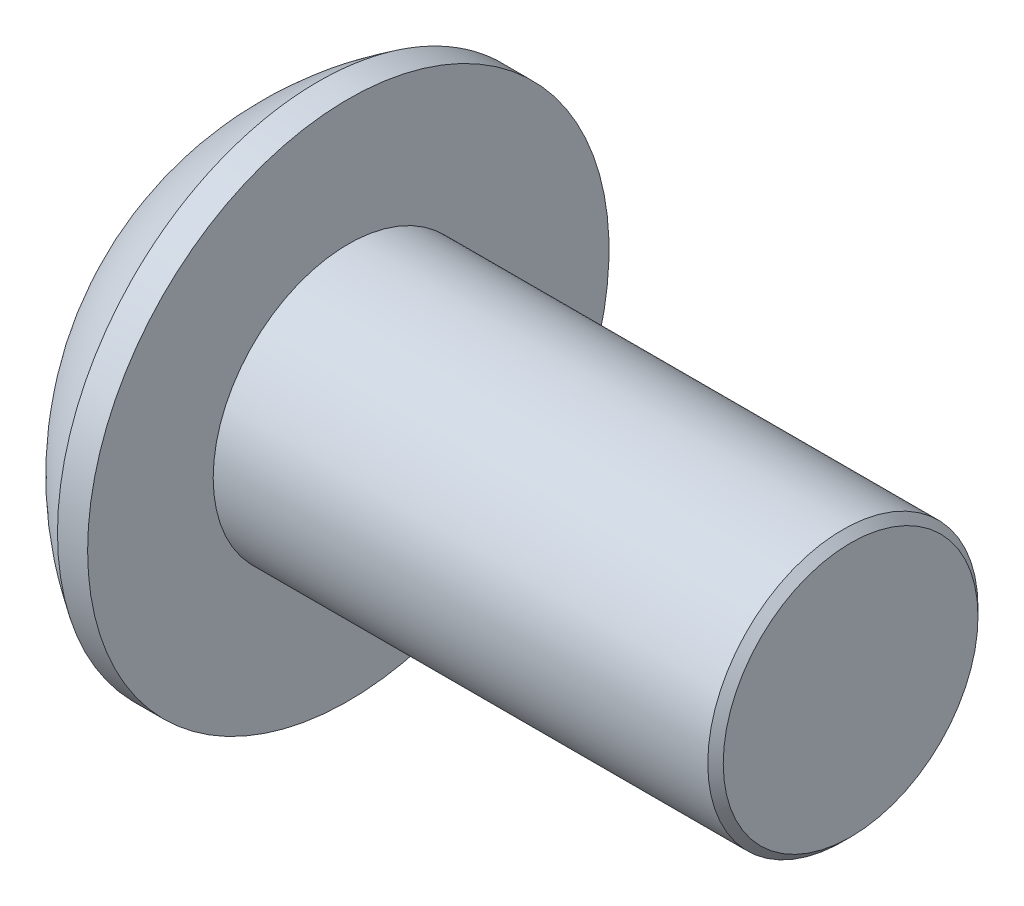
ISO-10303-21;
HEADER;
FILE_DESCRIPTION(('STEP AP214'),'2;1');
FILE_NAME('part.step','',(''),(''),'','','');
FILE_SCHEMA(('AUTOMOTIVE_DESIGN { 1 0 10303 214 1 1 1 1 }'));
ENDSEC;
DATA;
#1=APPLICATION_CONTEXT('core data for automotive mechanical design processes');
#2=APPLICATION_PROTOCOL_DEFINITION('international standard','automotive_design',2000,#1);
#3=PRODUCT_CONTEXT('',#1,'mechanical');
#4=PRODUCT('Part','Part','',(#3));
#5=PRODUCT_RELATED_PRODUCT_CATEGORY('part','',(#4));
#6=PRODUCT_DEFINITION_FORMATION('','',#4);
#7=PRODUCT_DEFINITION_CONTEXT('part definition',#1,'design');
#8=PRODUCT_DEFINITION('design','',#6,#7);
#9=PRODUCT_DEFINITION_SHAPE('','',#8);
#10=(LENGTH_UNIT() NAMED_UNIT(*) SI_UNIT(.MILLI.,.METRE.));
#11=(NAMED_UNIT(*) PLANE_ANGLE_UNIT() SI_UNIT($,.RADIAN.));
#12=(NAMED_UNIT(*) SI_UNIT($,.STERADIAN.) SOLID_ANGLE_UNIT());
#13=UNCERTAINTY_MEASURE_WITH_UNIT(LENGTH_MEASURE(1.E-05),#10,'distance_accuracy_value','');
#14=(GEOMETRIC_REPRESENTATION_CONTEXT(3) GLOBAL_UNCERTAINTY_ASSIGNED_CONTEXT((#13)) GLOBAL_UNIT_ASSIGNED_CONTEXT((#10,
#11,#12)) REPRESENTATION_CONTEXT('',''));
#15=CARTESIAN_POINT('',(0.,0.,0.));
#16=DIRECTION('',(0.,0.,1.));
#17=DIRECTION('',(1.,0.,0.));
#18=AXIS2_PLACEMENT_3D('',#15,#16,#17);
#19=CARTESIAN_POINT('',(1.32080000000034,0.,0.));
#20=DIRECTION('',(-1.,0.,0.));
#21=DIRECTION('',(0.,0.,1.));
#22=AXIS2_PLACEMENT_3D('',#19,#20,#21);
#23=CONICAL_SURFACE('',#22,1.1937999999998,1.04719755119608);
#24=CARTESIAN_POINT('',(2.01004075135902,0.,4.44089209850063E-13));
#25=VERTEX_POINT('',#24);
#26=VERTEX_LOOP('',#25);
#27=FACE_BOUND('',#26,.T.);
#28=CARTESIAN_POINT('',(1.32080000000009,0.,0.));
#29=DIRECTION('',(-1.,0.,0.));
#30=DIRECTION('',(0.,0.,1.));
#31=AXIS2_PLACEMENT_3D('',#28,#29,#30);
#32=CIRCLE('',#31,1.19380000000024);
#33=CARTESIAN_POINT('',(1.32080000000004,0.,1.19380000000012));
#34=VERTEX_POINT('',#33);
#35=CARTESIAN_POINT('',(1.32080000000004,-1.03386112703797,0.596900000000061));
#36=VERTEX_POINT('',#35);
#37=EDGE_CURVE('E20',#34,#36,#32,.F.);
#38=ORIENTED_EDGE('',*,*,#37,.F.);
#39=CARTESIAN_POINT('',(1.32080000000009,0.,0.));
#40=DIRECTION('',(-1.,0.,0.));
#41=DIRECTION('',(0.,0.,1.));
#42=AXIS2_PLACEMENT_3D('',#39,#40,#41);
#43=CIRCLE('',#42,1.19380000000024);
#44=CARTESIAN_POINT('',(1.32080000000004,1.03386112703797,0.596900000000063));
#45=VERTEX_POINT('',#44);
#46=EDGE_CURVE('E90',#45,#34,#43,.F.);
#47=ORIENTED_EDGE('',*,*,#46,.F.);
#48=CARTESIAN_POINT('',(1.32080000000009,0.,0.));
#49=DIRECTION('',(-1.,0.,0.));
#50=DIRECTION('',(0.,0.,1.));
#51=AXIS2_PLACEMENT_3D('',#48,#49,#50);
#52=CIRCLE('',#51,1.19380000000024);
#53=CARTESIAN_POINT('',(1.32080000000004,1.03386112703797,-0.596900000000063));
#54=VERTEX_POINT('',#53);
#55=EDGE_CURVE('E106',#54,#45,#52,.F.);
#56=ORIENTED_EDGE('',*,*,#55,.F.);
#57=CARTESIAN_POINT('',(1.32080000000009,0.,0.));
#58=DIRECTION('',(-1.,0.,0.));
#59=DIRECTION('',(0.,0.,1.));
#60=AXIS2_PLACEMENT_3D('',#57,#58,#59);
#61=CIRCLE('',#60,1.19380000000024);
#62=CARTESIAN_POINT('',(1.32080000000004,1.49420287879031E-12,-1.19380000000012));
#63=VERTEX_POINT('',#62);
#64=EDGE_CURVE('E450',#63,#54,#61,.F.);
#65=ORIENTED_EDGE('',*,*,#64,.F.);
#66=CARTESIAN_POINT('',(1.32080000000009,0.,0.));
#67=DIRECTION('',(-1.,0.,0.));
#68=DIRECTION('',(0.,0.,1.));
#69=AXIS2_PLACEMENT_3D('',#66,#67,#68);
#70=CIRCLE('',#69,1.19380000000024);
#71=CARTESIAN_POINT('',(1.32080000000004,-1.03386112703797,-0.596900000000062));
#72=VERTEX_POINT('',#71);
#73=EDGE_CURVE('E453',#72,#63,#70,.F.);
#74=ORIENTED_EDGE('',*,*,#73,.F.);
#75=CARTESIAN_POINT('',(1.32080000000009,0.,0.));
#76=DIRECTION('',(-1.,0.,0.));
#77=DIRECTION('',(0.,0.,1.));
#78=AXIS2_PLACEMENT_3D('',#75,#76,#77);
#79=CIRCLE('',#78,1.19380000000024);
#80=EDGE_CURVE('E93',#36,#72,#79,.F.);
#81=ORIENTED_EDGE('',*,*,#80,.F.);
#82=EDGE_LOOP('',(#38,#47,#56,#65,#74,#81));
#83=FACE_BOUND('',#82,.T.);
#84=ADVANCED_FACE('F17',(#27,#83),#23,.F.);
#85=CARTESIAN_POINT('',(1.3208,0.,2.3876));
#86=DIRECTION('',(-1.,0.,0.));
#87=DIRECTION('',(0.,0.,1.));
#88=AXIS2_PLACEMENT_3D('',#85,#86,#87);
#89=PLANE('',#88);
#90=DIRECTION('',(0.,1.,0.));
#91=VECTOR('',#90,1.);
#92=CARTESIAN_POINT('',(1.3208,-0.689240751358576,1.1938));
#93=LINE('',#92,#91);
#94=CARTESIAN_POINT('',(1.3208,-0.689240751358576,1.1938));
#95=VERTEX_POINT('',#94);
#96=EDGE_CURVE('E109',#34,#95,#93,.F.);
#97=ORIENTED_EDGE('',*,*,#96,.F.);
#98=ORIENTED_EDGE('',*,*,#37,.T.);
#99=DIRECTION('',(0.,0.5,0.866025403784439));
#100=VECTOR('',#99,1.);
#101=CARTESIAN_POINT('',(1.3208,-1.37848150271715,0.));
#102=LINE('',#101,#100);
#103=EDGE_CURVE('E112',#95,#36,#102,.F.);
#104=ORIENTED_EDGE('',*,*,#103,.F.);
#105=EDGE_LOOP('',(#97,#98,#104));
#106=FACE_BOUND('',#105,.T.);
#107=ADVANCED_FACE('F110',(#106),#89,.T.);
#108=CARTESIAN_POINT('',(1.3208,0.,2.3876));
#109=DIRECTION('',(-1.,0.,0.));
#110=DIRECTION('',(0.,0.,1.));
#111=AXIS2_PLACEMENT_3D('',#108,#109,#110);
#112=PLANE('',#111);
#113=DIRECTION('',(0.,0.5,0.866025403784439));
#114=VECTOR('',#113,1.);
#115=CARTESIAN_POINT('',(1.3208,-1.37848150271715,0.));
#116=LINE('',#115,#114);
#117=CARTESIAN_POINT('',(1.3208,-1.37848150271715,0.));
#118=VERTEX_POINT('',#117);
#119=EDGE_CURVE('E172',#36,#118,#116,.F.);
#120=ORIENTED_EDGE('',*,*,#119,.F.);
#121=ORIENTED_EDGE('',*,*,#80,.T.);
#122=DIRECTION('',(0.,-0.5,0.866025403784439));
#123=VECTOR('',#122,1.);
#124=CARTESIAN_POINT('',(1.3208,-0.689240751358576,-1.1938));
#125=LINE('',#124,#123);
#126=EDGE_CURVE('E160',#118,#72,#125,.F.);
#127=ORIENTED_EDGE('',*,*,#126,.F.);
#128=EDGE_LOOP('',(#120,#121,#127));
#129=FACE_BOUND('',#128,.T.);
#130=ADVANCED_FACE('F250',(#129),#112,.T.);
#131=CARTESIAN_POINT('',(1.3208,0.,2.3876));
#132=DIRECTION('',(-1.,0.,0.));
#133=DIRECTION('',(0.,0.,1.));
#134=AXIS2_PLACEMENT_3D('',#131,#132,#133);
#135=PLANE('',#134);
#136=DIRECTION('',(0.,-0.5,0.866025403784439));
#137=VECTOR('',#136,1.);
#138=CARTESIAN_POINT('',(1.3208,-0.689240751358576,-1.1938));
#139=LINE('',#138,#137);
#140=CARTESIAN_POINT('',(1.3208,-0.689240751358576,-1.1938));
#141=VERTEX_POINT('',#140);
#142=EDGE_CURVE('E157',#72,#141,#139,.F.);
#143=ORIENTED_EDGE('',*,*,#142,.F.);
#144=ORIENTED_EDGE('',*,*,#73,.T.);
#145=DIRECTION('',(0.,-1.,0.));
#146=VECTOR('',#145,1.);
#147=CARTESIAN_POINT('',(1.3208,0.689240751358575,-1.1938));
#148=LINE('',#147,#146);
#149=EDGE_CURVE('E144',#141,#63,#148,.F.);
#150=ORIENTED_EDGE('',*,*,#149,.F.);
#151=EDGE_LOOP('',(#143,#144,#150));
#152=FACE_BOUND('',#151,.T.);
#153=ADVANCED_FACE('F246',(#152),#135,.T.);
#154=CARTESIAN_POINT('',(1.3208,0.,2.3876));
#155=DIRECTION('',(-1.,0.,0.));
#156=DIRECTION('',(0.,0.,1.));
#157=AXIS2_PLACEMENT_3D('',#154,#155,#156);
#158=PLANE('',#157);
#159=DIRECTION('',(0.,-1.,0.));
#160=VECTOR('',#159,1.);
#161=CARTESIAN_POINT('',(1.3208,0.689240751358575,-1.1938));
#162=LINE('',#161,#160);
#163=CARTESIAN_POINT('',(1.3208,0.689240751358575,-1.1938));
#164=VERTEX_POINT('',#163);
#165=EDGE_CURVE('E141',#63,#164,#162,.F.);
#166=ORIENTED_EDGE('',*,*,#165,.F.);
#167=ORIENTED_EDGE('',*,*,#64,.T.);
#168=DIRECTION('',(0.,-0.500000000000001,-0.866025403784438));
#169=VECTOR('',#168,1.);
#170=CARTESIAN_POINT('',(1.3208,1.37848150271715,0.));
#171=LINE('',#170,#169);
#172=EDGE_CURVE('E129',#164,#54,#171,.F.);
#173=ORIENTED_EDGE('',*,*,#172,.F.);
#174=EDGE_LOOP('',(#166,#167,#173));
#175=FACE_BOUND('',#174,.T.);
#176=ADVANCED_FACE('F242',(#175),#158,.T.);
#177=CARTESIAN_POINT('',(1.3208,0.,2.3876));
#178=DIRECTION('',(-1.,0.,0.));
#179=DIRECTION('',(0.,0.,1.));
#180=AXIS2_PLACEMENT_3D('',#177,#178,#179);
#181=PLANE('',#180);
#182=DIRECTION('',(0.,-0.500000000000001,-0.866025403784438));
#183=VECTOR('',#182,1.);
#184=CARTESIAN_POINT('',(1.3208,1.37848150271715,0.));
#185=LINE('',#184,#183);
#186=CARTESIAN_POINT('',(1.3208,1.37848150271715,0.));
#187=VERTEX_POINT('',#186);
#188=EDGE_CURVE('E126',#54,#187,#185,.F.);
#189=ORIENTED_EDGE('',*,*,#188,.F.);
#190=ORIENTED_EDGE('',*,*,#55,.T.);
#191=DIRECTION('',(0.,0.500000000000001,-0.866025403784438));
#192=VECTOR('',#191,1.);
#193=CARTESIAN_POINT('',(1.3208,0.689240751358575,1.1938));
#194=LINE('',#193,#192);
#195=EDGE_CURVE('E149',#187,#45,#194,.F.);
#196=ORIENTED_EDGE('',*,*,#195,.F.);
#197=EDGE_LOOP('',(#189,#190,#196));
#198=FACE_BOUND('',#197,.T.);
#199=ADVANCED_FACE('F239',(#198),#181,.T.);
#200=CARTESIAN_POINT('',(1.3208,0.,2.3876));
#201=DIRECTION('',(-1.,0.,0.));
#202=DIRECTION('',(0.,0.,1.));
#203=AXIS2_PLACEMENT_3D('',#200,#201,#202);
#204=PLANE('',#203);
#205=DIRECTION('',(0.,0.500000000000001,-0.866025403784438));
#206=VECTOR('',#205,1.);
#207=CARTESIAN_POINT('',(1.3208,0.689240751358575,1.1938));
#208=LINE('',#207,#206);
#209=CARTESIAN_POINT('',(1.3208,0.689240751358575,1.1938));
#210=VERTEX_POINT('',#209);
#211=EDGE_CURVE('E104',#45,#210,#208,.F.);
#212=ORIENTED_EDGE('',*,*,#211,.F.);
#213=ORIENTED_EDGE('',*,*,#46,.T.);
#214=DIRECTION('',(0.,1.,0.));
#215=VECTOR('',#214,1.);
#216=CARTESIAN_POINT('',(1.3208,-0.689240751358576,1.1938));
#217=LINE('',#216,#215);
#218=EDGE_CURVE('E101',#210,#34,#217,.F.);
#219=ORIENTED_EDGE('',*,*,#218,.F.);
#220=EDGE_LOOP('',(#212,#213,#219));
#221=FACE_BOUND('',#220,.T.);
#222=ADVANCED_FACE('F99',(#221),#204,.T.);
#223=CARTESIAN_POINT('',(1.3208,-0.689240751358576,1.1938));
#224=DIRECTION('',(0.,0.,-1.));
#225=DIRECTION('',(0.,1.,0.));
#226=AXIS2_PLACEMENT_3D('',#223,#224,#225);
#227=PLANE('',#226);
#228=DIRECTION('',(0.,1.,0.));
#229=VECTOR('',#228,1.);
#230=CARTESIAN_POINT('',(0.,0.,1.1938));
#231=LINE('',#230,#229);
#232=CARTESIAN_POINT('',(0.,0.689240751358575,1.1938));
#233=VERTEX_POINT('',#232);
#234=CARTESIAN_POINT('',(0.,-0.689240751358576,1.1938));
#235=VERTEX_POINT('',#234);
#236=EDGE_CURVE('E133',#233,#235,#231,.F.);
#237=ORIENTED_EDGE('',*,*,#236,.F.);
#238=DIRECTION('',(1.,0.,0.));
#239=VECTOR('',#238,1.);
#240=CARTESIAN_POINT('',(1.3208,0.689240751358575,1.1938));
#241=LINE('',#240,#239);
#242=EDGE_CURVE('E118',#210,#233,#241,.F.);
#243=ORIENTED_EDGE('',*,*,#242,.F.);
#244=ORIENTED_EDGE('',*,*,#218,.T.);
#245=ORIENTED_EDGE('',*,*,#96,.T.);
#246=DIRECTION('',(1.,0.,0.));
#247=VECTOR('',#246,1.);
#248=CARTESIAN_POINT('',(1.3208,-0.689240751358576,1.1938));
#249=LINE('',#248,#247);
#250=EDGE_CURVE('E169',#235,#95,#249,.T.);
#251=ORIENTED_EDGE('',*,*,#250,.F.);
#252=EDGE_LOOP('',(#237,#243,#244,#245,#251));
#253=FACE_BOUND('',#252,.T.);
#254=ADVANCED_FACE('F116',(#253),#227,.T.);
#255=CARTESIAN_POINT('',(1.3208,-1.37848150271715,0.));
#256=DIRECTION('',(0.,0.866025403784439,-0.5));
#257=DIRECTION('',(0.,0.5,0.866025403784439));
#258=AXIS2_PLACEMENT_3D('',#255,#256,#257);
#259=PLANE('',#258);
#260=DIRECTION('',(0.,-0.5,-0.866025403784439));
#261=VECTOR('',#260,1.);
#262=CARTESIAN_POINT('',(0.,-0.689240751358576,1.1938));
#263=LINE('',#262,#261);
#264=CARTESIAN_POINT('',(0.,-1.37848150271715,0.));
#265=VERTEX_POINT('',#264);
#266=EDGE_CURVE('E437',#235,#265,#263,.T.);
#267=ORIENTED_EDGE('',*,*,#266,.F.);
#268=ORIENTED_EDGE('',*,*,#250,.T.);
#269=ORIENTED_EDGE('',*,*,#103,.T.);
#270=ORIENTED_EDGE('',*,*,#119,.T.);
#271=DIRECTION('',(1.,0.,0.));
#272=VECTOR('',#271,1.);
#273=CARTESIAN_POINT('',(1.3208,-1.37848150271715,0.));
#274=LINE('',#273,#272);
#275=EDGE_CURVE('E154',#265,#118,#274,.T.);
#276=ORIENTED_EDGE('',*,*,#275,.F.);
#277=EDGE_LOOP('',(#267,#268,#269,#270,#276));
#278=FACE_BOUND('',#277,.T.);
#279=ADVANCED_FACE('F230',(#278),#259,.T.);
#280=CARTESIAN_POINT('',(1.3208,-0.689240751358576,-1.1938));
#281=DIRECTION('',(0.,0.866025403784439,0.5));
#282=DIRECTION('',(0.,-0.5,0.866025403784439));
#283=AXIS2_PLACEMENT_3D('',#280,#281,#282);
#284=PLANE('',#283);
#285=DIRECTION('',(0.,0.5,-0.866025403784439));
#286=VECTOR('',#285,1.);
#287=CARTESIAN_POINT('',(0.,-1.37848150271715,0.));
#288=LINE('',#287,#286);
#289=CARTESIAN_POINT('',(0.,-0.689240751358576,-1.1938));
#290=VERTEX_POINT('',#289);
#291=EDGE_CURVE('E434',#265,#290,#288,.T.);
#292=ORIENTED_EDGE('',*,*,#291,.F.);
#293=ORIENTED_EDGE('',*,*,#275,.T.);
#294=ORIENTED_EDGE('',*,*,#126,.T.);
#295=ORIENTED_EDGE('',*,*,#142,.T.);
#296=DIRECTION('',(1.,0.,0.));
#297=VECTOR('',#296,1.);
#298=CARTESIAN_POINT('',(1.3208,-0.689240751358576,-1.1938));
#299=LINE('',#298,#297);
#300=EDGE_CURVE('E138',#290,#141,#299,.T.);
#301=ORIENTED_EDGE('',*,*,#300,.F.);
#302=EDGE_LOOP('',(#292,#293,#294,#295,#301));
#303=FACE_BOUND('',#302,.T.);
#304=ADVANCED_FACE('F226',(#303),#284,.T.);
#305=CARTESIAN_POINT('',(1.3208,0.689240751358575,-1.1938));
#306=DIRECTION('',(0.,0.,1.));
#307=DIRECTION('',(0.,-1.,0.));
#308=AXIS2_PLACEMENT_3D('',#305,#306,#307);
#309=PLANE('',#308);
#310=DIRECTION('',(0.,1.,0.));
#311=VECTOR('',#310,1.);
#312=CARTESIAN_POINT('',(0.,0.,-1.1938));
#313=LINE('',#312,#311);
#314=CARTESIAN_POINT('',(0.,0.689240751358575,-1.1938));
#315=VERTEX_POINT('',#314);
#316=EDGE_CURVE('E431',#290,#315,#313,.T.);
#317=ORIENTED_EDGE('',*,*,#316,.F.);
#318=ORIENTED_EDGE('',*,*,#300,.T.);
#319=ORIENTED_EDGE('',*,*,#149,.T.);
#320=ORIENTED_EDGE('',*,*,#165,.T.);
#321=DIRECTION('',(1.,0.,0.));
#322=VECTOR('',#321,1.);
#323=CARTESIAN_POINT('',(1.3208,0.689240751358575,-1.1938));
#324=LINE('',#323,#322);
#325=EDGE_CURVE('E128',#315,#164,#324,.T.);
#326=ORIENTED_EDGE('',*,*,#325,.F.);
#327=EDGE_LOOP('',(#317,#318,#319,#320,#326));
#328=FACE_BOUND('',#327,.T.);
#329=ADVANCED_FACE('F223',(#328),#309,.T.);
#330=CARTESIAN_POINT('',(1.3208,1.37848150271715,0.));
#331=DIRECTION('',(0.,-0.866025403784438,0.500000000000001));
#332=DIRECTION('',(0.,-0.500000000000001,-0.866025403784438));
#333=AXIS2_PLACEMENT_3D('',#330,#331,#332);
#334=PLANE('',#333);
#335=DIRECTION('',(0.,0.500000000000001,0.866025403784438));
#336=VECTOR('',#335,1.);
#337=CARTESIAN_POINT('',(0.,0.689240751358575,-1.1938));
#338=LINE('',#337,#336);
#339=CARTESIAN_POINT('',(0.,1.37848150271715,0.));
#340=VERTEX_POINT('',#339);
#341=EDGE_CURVE('E428',#315,#340,#338,.T.);
#342=ORIENTED_EDGE('',*,*,#341,.F.);
#343=ORIENTED_EDGE('',*,*,#325,.T.);
#344=ORIENTED_EDGE('',*,*,#172,.T.);
#345=ORIENTED_EDGE('',*,*,#188,.T.);
#346=DIRECTION('',(1.,0.,0.));
#347=VECTOR('',#346,1.);
#348=CARTESIAN_POINT('',(1.3208,1.37848150271715,0.));
#349=LINE('',#348,#347);
#350=EDGE_CURVE('E35',#340,#187,#349,.T.);
#351=ORIENTED_EDGE('',*,*,#350,.F.);
#352=EDGE_LOOP('',(#342,#343,#344,#345,#351));
#353=FACE_BOUND('',#352,.T.);
#354=ADVANCED_FACE('F219',(#353),#334,.T.);
#355=CARTESIAN_POINT('',(1.3208,0.689240751358575,1.1938));
#356=DIRECTION('',(0.,-0.866025403784438,-0.500000000000001));
#357=DIRECTION('',(0.,0.500000000000001,-0.866025403784438));
#358=AXIS2_PLACEMENT_3D('',#355,#356,#357);
#359=PLANE('',#358);
#360=DIRECTION('',(0.,-0.500000000000001,0.866025403784438));
#361=VECTOR('',#360,1.);
#362=CARTESIAN_POINT('',(0.,1.37848150271715,0.));
#363=LINE('',#362,#361);
#364=EDGE_CURVE('E205',#340,#233,#363,.T.);
#365=ORIENTED_EDGE('',*,*,#364,.F.);
#366=ORIENTED_EDGE('',*,*,#350,.T.);
#367=ORIENTED_EDGE('',*,*,#195,.T.);
#368=ORIENTED_EDGE('',*,*,#211,.T.);
#369=ORIENTED_EDGE('',*,*,#242,.T.);
#370=EDGE_LOOP('',(#365,#366,#367,#368,#369));
#371=FACE_BOUND('',#370,.T.);
#372=ADVANCED_FACE('F215',(#371),#359,.T.);
#373=CARTESIAN_POINT('',(0.,0.,0.));
#374=DIRECTION('',(-1.,0.,0.));
#375=DIRECTION('',(0.,0.,1.));
#376=AXIS2_PLACEMENT_3D('',#373,#374,#375);
#377=PLANE('',#376);
#378=ORIENTED_EDGE('',*,*,#341,.T.);
#379=ORIENTED_EDGE('',*,*,#364,.T.);
#380=ORIENTED_EDGE('',*,*,#236,.T.);
#381=ORIENTED_EDGE('',*,*,#266,.T.);
#382=ORIENTED_EDGE('',*,*,#291,.T.);
#383=ORIENTED_EDGE('',*,*,#316,.T.);
#384=EDGE_LOOP('',(#378,#379,#380,#381,#382,#383));
#385=FACE_BOUND('',#384,.T.);
#386=CARTESIAN_POINT('',(0.,1.647825,0.));
#387=CARTESIAN_POINT('',(1.6308873576372E-13,1.64781976319874,0.0924902039777533));
#388=CARTESIAN_POINT('',(1.32723456051501E-13,1.63999511633709,0.185145014326371));
#389=CARTESIAN_POINT('',(0.,1.6167119250047,0.322075808080014));
#390=CARTESIAN_POINT('',(-1.58307829769064E-13,1.60700618770234,0.367435533396361));
#391=CARTESIAN_POINT('',(1.5887042259766E-13,1.58380101865853,0.457220935695141));
#392=CARTESIAN_POINT('',(5.68553662672778E-13,1.5702985083103,0.501645823115265));
#393=CARTESIAN_POINT('',(9.36169533411239E-13,1.52428156574313,0.632817459278969));
#394=CARTESIAN_POINT('',(0.,1.48621992666366,0.717681965518645));
#395=CARTESIAN_POINT('',(0.,1.39637079695658,0.879809706624018));
#396=CARTESIAN_POINT('',(7.82226199304679E-13,1.34458278455109,0.957072652379997));
#397=CARTESIAN_POINT('',(4.86961747456247E-13,1.25777784714521,1.06558770210238));
#398=CARTESIAN_POINT('',(1.3347006403413E-13,1.22729946114794,1.10054993332365));
#399=CARTESIAN_POINT('',(-1.32907906987598E-13,1.16354004969106,1.16775237388222));
#400=CARTESIAN_POINT('',(0.,1.13026175473033,1.19999517515816));
#401=CARTESIAN_POINT('',(0.,1.02649304340867,1.29236218866442));
#402=CARTESIAN_POINT('',(0.,0.952049986714078,1.34814848277713));
#403=CARTESIAN_POINT('',(0.,0.794895196754069,1.44639825105766));
#404=CARTESIAN_POINT('',(0.,0.712183775431296,1.48886222758992));
#405=CARTESIAN_POINT('',(0.,0.540796624265729,1.55930919813143));
#406=CARTESIAN_POINT('',(0.,0.452120958135285,1.58729234680269));
#407=CARTESIAN_POINT('',(0.,0.271332331080316,1.62797191307414));
#408=CARTESIAN_POINT('',(0.,0.179219351801787,1.64066824903626));
#409=CARTESIAN_POINT('',(0.,-0.00583077027841068,1.65041748705409));
#410=CARTESIAN_POINT('',(0.,-0.0987679130800802,1.64747038910979));
#411=CARTESIAN_POINT('',(0.,-0.282830196388828,1.62601274134436));
#412=CARTESIAN_POINT('',(0.,-0.373955346570022,1.60750227463795));
#413=CARTESIAN_POINT('',(0.,-0.551796068178808,1.55545413364524));
#414=CARTESIAN_POINT('',(0.,-0.63851159249817,1.52191629885844));
#415=CARTESIAN_POINT('',(0.,-0.805120175533158,1.44072378052347));
#416=CARTESIAN_POINT('',(0.,-0.88501297681996,1.39306856461394));
#417=CARTESIAN_POINT('',(0.,-0.997912879588364,1.31211658756413));
#418=CARTESIAN_POINT('',(0.,-1.0343949246834,1.28354906167735));
#419=CARTESIAN_POINT('',(0.,-1.10486279842069,1.2234182930371));
#420=CARTESIAN_POINT('',(0.,-1.13884618403291,1.19185218578118));
#421=CARTESIAN_POINT('',(0.,-1.23657300939909,1.09305906467359));
#422=CARTESIAN_POINT('',(0.,-1.29619288399357,1.02166556658613));
#423=CARTESIAN_POINT('',(0.,-1.40258050817756,0.869876423478037));
#424=CARTESIAN_POINT('',(0.,-1.44934874627767,0.789481120793482));
#425=CARTESIAN_POINT('',(0.,-1.50889406070376,0.663870959313345));
#426=CARTESIAN_POINT('',(0.,-1.52698985473587,0.621110806760431));
#427=CARTESIAN_POINT('',(0.,-1.55950093966665,0.534260776864335));
#428=CARTESIAN_POINT('',(-1.05039697618021E-13,-1.57391920916439,0.490172008203172));
#429=CARTESIAN_POINT('',(2.10178020665955E-13,-1.6114617790958,0.356445777718599));
#430=CARTESIAN_POINT('',(1.14251859340662E-12,-1.62897899568075,0.265126085962908));
#431=CARTESIAN_POINT('',(4.34048914238184E-13,-1.6417434721491,0.144386595969389));
#432=CARTESIAN_POINT('',(1.2133871111091E-13,-1.64402207668917,0.115560405797876));
#433=CARTESIAN_POINT('',(-1.2090503024199E-13,-1.64706365940122,0.0578281757252701));
#434=CARTESIAN_POINT('',(0.,-1.64782663757319,0.0289221358241782));
#435=CARTESIAN_POINT('',(1.64938783669285E-13,-1.64781976319875,-0.0924902039777538));
#436=CARTESIAN_POINT('',(1.33063346980503E-13,-1.63999511633711,-0.18514501432637));
#437=CARTESIAN_POINT('',(0.,-1.61671192500471,-0.322075808080014));
#438=CARTESIAN_POINT('',(-1.58354507530811E-13,-1.60700618770236,-0.367435533396362));
#439=CARTESIAN_POINT('',(1.58917138317674E-13,-1.58380101865854,-0.457220935695141));
#440=CARTESIAN_POINT('',(5.68569932116631E-13,-1.57029850831032,-0.501645823115264));
#441=CARTESIAN_POINT('',(9.36137072078051E-13,-1.52428156574314,-0.632817459278968));
#442=CARTESIAN_POINT('',(0.,-1.48621992666367,-0.717681965518645));
#443=CARTESIAN_POINT('',(0.,-1.3963707969566,-0.879809706624018));
#444=CARTESIAN_POINT('',(7.8222767876737E-13,-1.34458278455111,-0.957072652379997));
#445=CARTESIAN_POINT('',(4.86961006755577E-13,-1.25777784714523,-1.06558770210238));
#446=CARTESIAN_POINT('',(1.33469967938541E-13,-1.22729946114795,-1.10054993332365));
#447=CARTESIAN_POINT('',(-1.32907810984659E-13,-1.16354004969108,-1.16775237388222));
#448=CARTESIAN_POINT('',(0.,-1.13026175473034,-1.19999517515816));
#449=CARTESIAN_POINT('',(0.,-1.02649304340868,-1.29236218866442));
#450=CARTESIAN_POINT('',(0.,-0.952049986714093,-1.34814848277713));
#451=CARTESIAN_POINT('',(0.,-0.794895196754083,-1.44639825105766));
#452=CARTESIAN_POINT('',(0.,-0.71218377543131,-1.48886222758992));
#453=CARTESIAN_POINT('',(0.,-0.540796624265743,-1.55930919813143));
#454=CARTESIAN_POINT('',(0.,-0.452120958135299,-1.58729234680269));
#455=CARTESIAN_POINT('',(0.,-0.27133233108033,-1.62797191307414));
#456=CARTESIAN_POINT('',(0.,-0.179219351801801,-1.64066824903626));
#457=CARTESIAN_POINT('',(0.,0.00583077027839649,-1.65041748705409));
#458=CARTESIAN_POINT('',(0.,0.0987679130800661,-1.64747038910979));
#459=CARTESIAN_POINT('',(0.,0.282830196388813,-1.62601274134436));
#460=CARTESIAN_POINT('',(0.,0.373955346570007,-1.60750227463795));
#461=CARTESIAN_POINT('',(0.,0.551796068178793,-1.55545413364524));
#462=CARTESIAN_POINT('',(0.,0.638511592498156,-1.52191629885844));
#463=CARTESIAN_POINT('',(0.,0.805120175533144,-1.44072378052347));
#464=CARTESIAN_POINT('',(0.,0.885012976819946,-1.39306856461394));
#465=CARTESIAN_POINT('',(0.,0.99791287958835,-1.31211658756413));
#466=CARTESIAN_POINT('',(0.,1.03439492468339,-1.28354906167735));
#467=CARTESIAN_POINT('',(0.,1.10486279842068,-1.2234182930371));
#468=CARTESIAN_POINT('',(0.,1.1388461840329,-1.19185218578118));
#469=CARTESIAN_POINT('',(0.,1.23657300939908,-1.09305906467359));
#470=CARTESIAN_POINT('',(0.,1.29619288399356,-1.02166556658613));
#471=CARTESIAN_POINT('',(0.,1.40258050817755,-0.869876423478036));
#472=CARTESIAN_POINT('',(0.,1.44934874627766,-0.789481120793482));
#473=CARTESIAN_POINT('',(0.,1.50889406070375,-0.663870959313345));
#474=CARTESIAN_POINT('',(0.,1.52698985473586,-0.621110806760431));
#475=CARTESIAN_POINT('',(0.,1.55950093966663,-0.534260776864334));
#476=CARTESIAN_POINT('',(-1.04953536136957E-13,1.57391920916437,-0.490172008203171));
#477=CARTESIAN_POINT('',(2.10006149477814E-13,1.61146177909579,-0.356445777718599));
#478=CARTESIAN_POINT('',(1.14225956750636E-12,1.62897899568074,-0.265126085962908));
#479=CARTESIAN_POINT('',(4.34129912894769E-13,1.64174347214908,-0.144386595969389));
#480=CARTESIAN_POINT('',(1.21534559462057E-13,1.64402207668915,-0.115560405797875));
#481=CARTESIAN_POINT('',(-1.21100878593138E-13,1.6470636594012,-0.0578281757252705));
#482=CARTESIAN_POINT('',(0.,1.64782663757318,-0.0289221358241788));
#483=CARTESIAN_POINT('',(0.,1.647825,0.));
#484=B_SPLINE_CURVE_WITH_KNOTS('',3,(#386,#387,#388,#389,#390,#391,#392,#393,#394,#395,#396,
#397,#398,#399,#400,#401,#402,#403,#404,#405,#406,#407,#408,#409,#410,#411,#412,#413,#414,#415,
#416,#417,#418,#419,#420,#421,#422,#423,#424,#425,#426,#427,#428,#429,#430,#431,#432,#433,#434,
#435,#436,#437,#438,#439,#440,#441,#442,#443,#444,#445,#446,#447,#448,#449,#450,#451,#452,#453,
#454,#455,#456,#457,#458,#459,#460,#461,#462,#463,#464,#465,#466,#467,#468,#469,#470,#471,#472,
#473,#474,#475,#476,#477,#478,#479,#480,#481,#482,#483),.UNSPECIFIED.,.T.,.F.,(4,2,2,2,2,2,2,2,
2,2,2,2,2,2,2,2,2,2,2,2,2,2,2,2,2,2,2,2,2,2,2,2,2,2,2,2,2,2,2,2,2,2,2,2,2,2,2,2,4),(0.,
0.277336029422427,0.416368541537112,0.555514114625601,0.833141970294989,1.11078038089036,
1.24978149120748,1.38864858351854,1.66629367015056,1.94392828594775,2.22155993641642,
2.49919306954938,2.77682620268235,3.05445785315102,3.33209246894821,3.60973755557991,
3.74860464789075,3.88760575820768,4.16524416880334,4.44287202447289,4.58201759756162,
4.72105010967663,4.99838613909884,5.08511046196679,5.17183478483479,5.44917081425721,
5.5882033263719,5.72734889946039,6.00497675512977,6.28261516572515,6.42161627604227,
6.56048336835333,6.83812845498535,7.11576307078254,7.39339472125121,7.67102785438416,
7.94866098751713,8.22629263798581,8.503927253783,8.7815723404147,8.92043943272554,
9.05944054304247,9.33707895363812,9.61470680930768,9.75385238239641,9.89288489451142,
10.1702209239336,10.2569452468016,10.3436695696696),.UNSPECIFIED.);
#485=CARTESIAN_POINT('',(0.,1.647825,0.));
#486=VERTEX_POINT('',#485);
#487=EDGE_CURVE('E198',#486,#486,#484,.T.);
#488=ORIENTED_EDGE('',*,*,#487,.F.);
#489=EDGE_LOOP('',(#488));
#490=FACE_BOUND('',#489,.T.);
#491=ADVANCED_FACE('F211',(#385,#490),#377,.T.);
#492=CARTESIAN_POINT('',(3.5013236260776,0.,0.));
#493=DIRECTION('',(0.,1.,0.));
#494=DIRECTION('',(1.,0.,0.));
#495=AXIS2_PLACEMENT_3D('',#492,#493,#494);
#496=SPHERICAL_SURFACE('',#495,3.86970210289554);
#497=CARTESIAN_POINT('',(1.4732,0.,0.));
#498=DIRECTION('',(-1.,0.,0.));
#499=DIRECTION('',(0.,0.,1.));
#500=AXIS2_PLACEMENT_3D('',#497,#498,#499);
#501=CIRCLE('',#500,3.29565);
#502=CARTESIAN_POINT('',(1.4732,0.,3.29565));
#503=VERTEX_POINT('',#502);
#504=EDGE_CURVE('E195',#503,#503,#501,.F.);
#505=ORIENTED_EDGE('',*,*,#504,.F.);
#506=EDGE_LOOP('',(#505));
#507=FACE_BOUND('',#506,.T.);
#508=ORIENTED_EDGE('',*,*,#487,.T.);
#509=EDGE_LOOP('',(#508));
#510=FACE_BOUND('',#509,.T.);
#511=ADVANCED_FACE('F207',(#507,#510),#496,.T.);
#512=CARTESIAN_POINT('',(8.2042,0.,0.));
#513=DIRECTION('',(-1.,0.,0.));
#514=DIRECTION('',(0.,0.,1.));
#515=AXIS2_PLACEMENT_3D('',#512,#513,#514);
#516=PLANE('',#515);
#517=CARTESIAN_POINT('',(8.20419999996602,0.,0.));
#518=DIRECTION('',(-1.,0.,0.));
#519=DIRECTION('',(0.,0.,1.));
#520=AXIS2_PLACEMENT_3D('',#517,#518,#519);
#521=CIRCLE('',#520,1.61035999997239);
#522=CARTESIAN_POINT('',(8.20419999996602,0.,1.61035999997239));
#523=VERTEX_POINT('',#522);
#524=EDGE_CURVE('E192',#523,#523,#521,.T.);
#525=ORIENTED_EDGE('',*,*,#524,.F.);
#526=EDGE_LOOP('',(#525));
#527=FACE_BOUND('',#526,.T.);
#528=ADVANCED_FACE('F278',(#527),#516,.F.);
#529=CARTESIAN_POINT('',(0.,0.,0.));
#530=DIRECTION('',(-1.,0.,0.));
#531=DIRECTION('',(0.,0.,1.));
#532=AXIS2_PLACEMENT_3D('',#529,#530,#531);
#533=CYLINDRICAL_SURFACE('',#532,3.29565);
#534=ORIENTED_EDGE('',*,*,#504,.T.);
#535=EDGE_LOOP('',(#534));
#536=FACE_BOUND('',#535,.T.);
#537=CARTESIAN_POINT('',(1.8542,0.,0.));
#538=DIRECTION('',(-1.,0.,0.));
#539=DIRECTION('',(0.,0.,1.));
#540=AXIS2_PLACEMENT_3D('',#537,#538,#539);
#541=CIRCLE('',#540,3.29565);
#542=CARTESIAN_POINT('',(1.8542,0.,3.29565));
#543=VERTEX_POINT('',#542);
#544=EDGE_CURVE('E189',#543,#543,#541,.T.);
#545=ORIENTED_EDGE('',*,*,#544,.T.);
#546=EDGE_LOOP('',(#545));
#547=FACE_BOUND('',#546,.T.);
#548=ADVANCED_FACE('F275',(#536,#547),#533,.T.);
#549=CARTESIAN_POINT('',(8.10641000009582,0.,0.));
#550=DIRECTION('',(-1.,0.,0.));
#551=DIRECTION('',(0.,0.,1.));
#552=AXIS2_PLACEMENT_3D('',#549,#550,#551);
#553=CONICAL_SURFACE('',#552,1.70814999989943,0.785398163688089);
#554=CARTESIAN_POINT('',(8.10641000000003,0.,0.));
#555=DIRECTION('',(-1.,0.,0.));
#556=DIRECTION('',(0.,0.,1.));
#557=AXIS2_PLACEMENT_3D('',#554,#555,#556);
#558=CIRCLE('',#557,1.70814999999999);
#559=CARTESIAN_POINT('',(8.10641000000003,0.,1.70814999999999));
#560=VERTEX_POINT('',#559);
#561=EDGE_CURVE('E26',#560,#560,#558,.T.);
#562=ORIENTED_EDGE('',*,*,#561,.F.);
#563=EDGE_LOOP('',(#562));
#564=FACE_BOUND('',#563,.T.);
#565=ORIENTED_EDGE('',*,*,#524,.T.);
#566=EDGE_LOOP('',(#565));
#567=FACE_BOUND('',#566,.T.);
#568=ADVANCED_FACE('F268',(#564,#567),#553,.T.);
#569=CARTESIAN_POINT('',(1.8542,1.70814999999999,0.));
#570=DIRECTION('',(-1.,0.,0.));
#571=DIRECTION('',(0.,0.,1.));
#572=AXIS2_PLACEMENT_3D('',#569,#570,#571);
#573=PLANE('',#572);
#574=CARTESIAN_POINT('',(1.8542,0.,0.));
#575=DIRECTION('',(-1.,0.,0.));
#576=DIRECTION('',(0.,0.,1.));
#577=AXIS2_PLACEMENT_3D('',#574,#575,#576);
#578=CIRCLE('',#577,1.70814999999999);
#579=CARTESIAN_POINT('',(1.8542,0.,1.70814999999999));
#580=VERTEX_POINT('',#579);
#581=EDGE_CURVE('E11',#580,#580,#578,.F.);
#582=ORIENTED_EDGE('',*,*,#581,.F.);
#583=EDGE_LOOP('',(#582));
#584=FACE_BOUND('',#583,.T.);
#585=ORIENTED_EDGE('',*,*,#544,.F.);
#586=EDGE_LOOP('',(#585));
#587=FACE_BOUND('',#586,.T.);
#588=ADVANCED_FACE('F262',(#584,#587),#573,.F.);
#589=CARTESIAN_POINT('',(0.,0.,0.));
#590=DIRECTION('',(-1.,0.,0.));
#591=DIRECTION('',(0.,0.,1.));
#592=AXIS2_PLACEMENT_3D('',#589,#590,#591);
#593=CYLINDRICAL_SURFACE('',#592,1.70814999999999);
#594=ORIENTED_EDGE('',*,*,#581,.T.);
#595=EDGE_LOOP('',(#594));
#596=FACE_BOUND('',#595,.T.);
#597=ORIENTED_EDGE('',*,*,#561,.T.);
#598=EDGE_LOOP('',(#597));
#599=FACE_BOUND('',#598,.T.);
#600=ADVANCED_FACE('F260',(#596,#599),#593,.T.);
#601=CLOSED_SHELL('',(#84,#107,#130,#153,#176,#199,#222,#254,#279,#304,#329,#354,#372,#491,#511,
#528,#548,#568,#588,#600));
#602=MANIFOLD_SOLID_BREP('B1',#601);
#603=ADVANCED_BREP_SHAPE_REPRESENTATION('',(#18,#602),#14);
#604=SHAPE_DEFINITION_REPRESENTATION(#9,#603);
ENDSEC;
END-ISO-10303-21;
